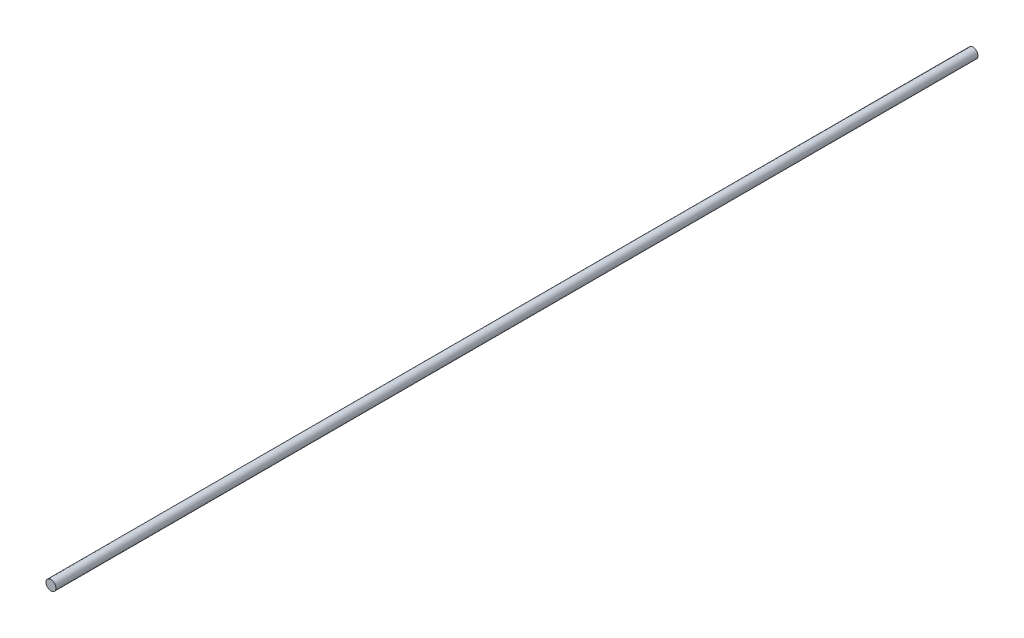
ISO-10303-21;
HEADER;
FILE_DESCRIPTION(('STEP AP214'),'2;1');
FILE_NAME('part.step','',(''),(''),'','','');
FILE_SCHEMA(('AUTOMOTIVE_DESIGN { 1 0 10303 214 1 1 1 1 }'));
ENDSEC;
DATA;
#1=APPLICATION_CONTEXT('core data for automotive mechanical design processes');
#2=APPLICATION_PROTOCOL_DEFINITION('international standard','automotive_design',2000,#1);
#3=PRODUCT_CONTEXT('',#1,'mechanical');
#4=PRODUCT('Part','Part','',(#3));
#5=PRODUCT_RELATED_PRODUCT_CATEGORY('part','',(#4));
#6=PRODUCT_DEFINITION_FORMATION('','',#4);
#7=PRODUCT_DEFINITION_CONTEXT('part definition',#1,'design');
#8=PRODUCT_DEFINITION('design','',#6,#7);
#9=PRODUCT_DEFINITION_SHAPE('','',#8);
#10=(LENGTH_UNIT() NAMED_UNIT(*) SI_UNIT(.MILLI.,.METRE.));
#11=(NAMED_UNIT(*) PLANE_ANGLE_UNIT() SI_UNIT($,.RADIAN.));
#12=(NAMED_UNIT(*) SI_UNIT($,.STERADIAN.) SOLID_ANGLE_UNIT());
#13=UNCERTAINTY_MEASURE_WITH_UNIT(LENGTH_MEASURE(1.E-05),#10,'distance_accuracy_value','');
#14=(GEOMETRIC_REPRESENTATION_CONTEXT(3) GLOBAL_UNCERTAINTY_ASSIGNED_CONTEXT((#13)) GLOBAL_UNIT_ASSIGNED_CONTEXT((#10,
#11,#12)) REPRESENTATION_CONTEXT('',''));
#15=CARTESIAN_POINT('',(0.,0.,0.));
#16=DIRECTION('',(0.,0.,1.));
#17=DIRECTION('',(1.,0.,0.));
#18=AXIS2_PLACEMENT_3D('',#15,#16,#17);
#19=CARTESIAN_POINT('',(0.,0.,2805.));
#20=DIRECTION('',(0.,0.,-1.));
#21=DIRECTION('',(-1.,0.,0.));
#22=AXIS2_PLACEMENT_3D('',#19,#20,#21);
#23=CYLINDRICAL_SURFACE('',#22,2.75);
#24=CARTESIAN_POINT('',(0.,0.,2805.));
#25=DIRECTION('',(0.,0.,1.));
#26=DIRECTION('',(1.,0.,0.));
#27=AXIS2_PLACEMENT_3D('',#24,#25,#26);
#28=CIRCLE('',#27,2.75);
#29=CARTESIAN_POINT('',(2.75,0.,2805.));
#30=VERTEX_POINT('',#29);
#31=EDGE_CURVE('E10',#30,#30,#28,.T.);
#32=ORIENTED_EDGE('',*,*,#31,.F.);
#33=EDGE_LOOP('',(#32));
#34=FACE_BOUND('',#33,.T.);
#35=CARTESIAN_POINT('',(0.,0.,2295.));
#36=DIRECTION('',(0.,0.,1.));
#37=DIRECTION('',(1.,0.,0.));
#38=AXIS2_PLACEMENT_3D('',#35,#36,#37);
#39=CIRCLE('',#38,2.75);
#40=CARTESIAN_POINT('',(2.75,0.,2295.));
#41=VERTEX_POINT('',#40);
#42=EDGE_CURVE('E44',#41,#41,#39,.T.);
#43=ORIENTED_EDGE('',*,*,#42,.T.);
#44=EDGE_LOOP('',(#43));
#45=FACE_BOUND('',#44,.T.);
#46=ADVANCED_FACE('F41',(#34,#45),#23,.T.);
#47=CARTESIAN_POINT('',(0.,0.,2805.));
#48=DIRECTION('',(0.,0.,1.));
#49=DIRECTION('',(1.,0.,0.));
#50=AXIS2_PLACEMENT_3D('',#47,#48,#49);
#51=PLANE('',#50);
#52=ORIENTED_EDGE('',*,*,#31,.T.);
#53=EDGE_LOOP('',(#52));
#54=FACE_BOUND('',#53,.T.);
#55=ADVANCED_FACE('F56',(#54),#51,.T.);
#56=CARTESIAN_POINT('',(0.,0.,2295.));
#57=DIRECTION('',(0.,0.,1.));
#58=DIRECTION('',(1.,0.,0.));
#59=AXIS2_PLACEMENT_3D('',#56,#57,#58);
#60=PLANE('',#59);
#61=ORIENTED_EDGE('',*,*,#42,.F.);
#62=EDGE_LOOP('',(#61));
#63=FACE_BOUND('',#62,.T.);
#64=ADVANCED_FACE('F54',(#63),#60,.F.);
#65=CLOSED_SHELL('',(#46,#55,#64));
#66=MANIFOLD_SOLID_BREP('B2',#65);
#67=ADVANCED_BREP_SHAPE_REPRESENTATION('',(#18,#66),#14);
#68=SHAPE_DEFINITION_REPRESENTATION(#9,#67);
ENDSEC;
END-ISO-10303-21;
